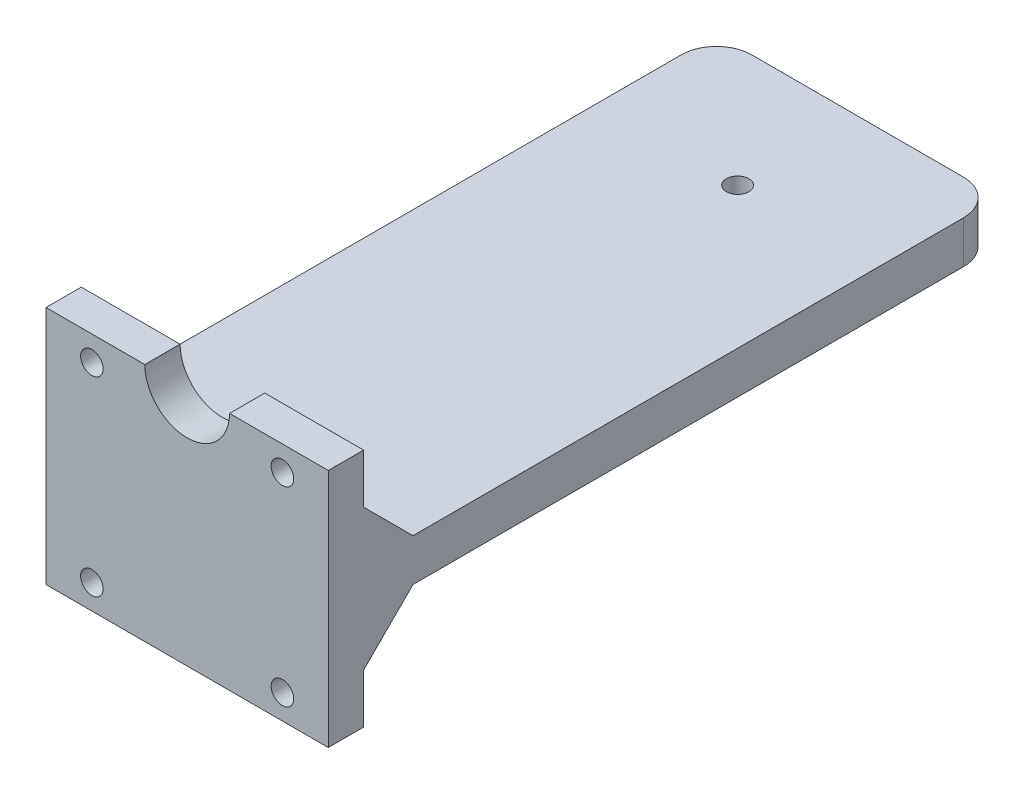
ISO-10303-21;
HEADER;
FILE_DESCRIPTION(('STEP AP214'),'2;1');
FILE_NAME('part.step','',(''),(''),'','','');
FILE_SCHEMA(('AUTOMOTIVE_DESIGN { 1 0 10303 214 1 1 1 1 }'));
ENDSEC;
DATA;
#1=APPLICATION_CONTEXT('core data for automotive mechanical design processes');
#2=APPLICATION_PROTOCOL_DEFINITION('international standard','automotive_design',2000,#1);
#3=PRODUCT_CONTEXT('',#1,'mechanical');
#4=PRODUCT('Part','Part','',(#3));
#5=PRODUCT_RELATED_PRODUCT_CATEGORY('part','',(#4));
#6=PRODUCT_DEFINITION_FORMATION('','',#4);
#7=PRODUCT_DEFINITION_CONTEXT('part definition',#1,'design');
#8=PRODUCT_DEFINITION('design','',#6,#7);
#9=PRODUCT_DEFINITION_SHAPE('','',#8);
#10=(LENGTH_UNIT() NAMED_UNIT(*) SI_UNIT(.MILLI.,.METRE.));
#11=(NAMED_UNIT(*) PLANE_ANGLE_UNIT() SI_UNIT($,.RADIAN.));
#12=(NAMED_UNIT(*) SI_UNIT($,.STERADIAN.) SOLID_ANGLE_UNIT());
#13=UNCERTAINTY_MEASURE_WITH_UNIT(LENGTH_MEASURE(1.E-05),#10,'distance_accuracy_value','');
#14=(GEOMETRIC_REPRESENTATION_CONTEXT(3) GLOBAL_UNCERTAINTY_ASSIGNED_CONTEXT((#13)) GLOBAL_UNIT_ASSIGNED_CONTEXT((#10,
#11,#12)) REPRESENTATION_CONTEXT('',''));
#15=CARTESIAN_POINT('',(0.,0.,0.));
#16=DIRECTION('',(0.,0.,1.));
#17=DIRECTION('',(1.,0.,0.));
#18=AXIS2_PLACEMENT_3D('',#15,#16,#17);
#19=CARTESIAN_POINT('',(0.,0.,0.));
#20=DIRECTION('',(0.,-1.,0.));
#21=DIRECTION('',(0.,0.,-1.));
#22=AXIS2_PLACEMENT_3D('',#19,#20,#21);
#23=PLANE('',#22);
#24=CARTESIAN_POINT('',(0.,0.,-78.));
#25=DIRECTION('',(0.,-1.,0.));
#26=DIRECTION('',(0.,0.,-1.));
#27=AXIS2_PLACEMENT_3D('',#24,#25,#26);
#28=CIRCLE('',#27,7.);
#29=CARTESIAN_POINT('',(0.,0.,-85.));
#30=VERTEX_POINT('',#29);
#31=EDGE_CURVE('E266',#30,#30,#28,.T.);
#32=ORIENTED_EDGE('',*,*,#31,.F.);
#33=EDGE_LOOP('',(#32));
#34=FACE_BOUND('',#33,.T.);
#35=DIRECTION('',(0.,0.,-1.));
#36=VECTOR('',#35,1.);
#37=CARTESIAN_POINT('',(20.,0.,-95.));
#38=LINE('',#37,#36);
#39=CARTESIAN_POINT('',(20.,0.,-12.));
#40=VERTEX_POINT('',#39);
#41=CARTESIAN_POINT('',(20.,0.,-90.));
#42=VERTEX_POINT('',#41);
#43=EDGE_CURVE('E155',#40,#42,#38,.T.);
#44=ORIENTED_EDGE('',*,*,#43,.F.);
#45=DIRECTION('',(-1.,0.,0.));
#46=VECTOR('',#45,1.);
#47=CARTESIAN_POINT('',(20.,0.,-12.));
#48=LINE('',#47,#46);
#49=CARTESIAN_POINT('',(-20.,0.,-12.));
#50=VERTEX_POINT('',#49);
#51=EDGE_CURVE('E141',#40,#50,#48,.T.);
#52=ORIENTED_EDGE('',*,*,#51,.T.);
#53=DIRECTION('',(0.,0.,1.));
#54=VECTOR('',#53,1.);
#55=CARTESIAN_POINT('',(-20.,0.,-95.));
#56=LINE('',#55,#54);
#57=CARTESIAN_POINT('',(-20.,0.,-90.));
#58=VERTEX_POINT('',#57);
#59=EDGE_CURVE('E167',#58,#50,#56,.T.);
#60=ORIENTED_EDGE('',*,*,#59,.F.);
#61=CARTESIAN_POINT('',(-15.,0.,-90.));
#62=DIRECTION('',(0.,-1.,0.));
#63=DIRECTION('',(0.,0.,-1.));
#64=AXIS2_PLACEMENT_3D('',#61,#62,#63);
#65=CIRCLE('',#64,5.);
#66=CARTESIAN_POINT('',(-15.,0.,-95.));
#67=VERTEX_POINT('',#66);
#68=EDGE_CURVE('E217',#58,#67,#65,.T.);
#69=ORIENTED_EDGE('',*,*,#68,.T.);
#70=DIRECTION('',(-1.,0.,0.));
#71=VECTOR('',#70,1.);
#72=CARTESIAN_POINT('',(20.,0.,-95.));
#73=LINE('',#72,#71);
#74=CARTESIAN_POINT('',(15.,0.,-95.));
#75=VERTEX_POINT('',#74);
#76=EDGE_CURVE('E166',#75,#67,#73,.T.);
#77=ORIENTED_EDGE('',*,*,#76,.F.);
#78=CARTESIAN_POINT('',(15.,0.,-90.));
#79=DIRECTION('',(0.,-1.,0.));
#80=DIRECTION('',(0.,0.,-1.));
#81=AXIS2_PLACEMENT_3D('',#78,#79,#80);
#82=CIRCLE('',#81,5.);
#83=EDGE_CURVE('E164',#75,#42,#82,.T.);
#84=ORIENTED_EDGE('',*,*,#83,.T.);
#85=EDGE_LOOP('',(#44,#52,#60,#69,#77,#84));
#86=FACE_BOUND('',#85,.T.);
#87=ADVANCED_FACE('F40',(#34,#86),#23,.T.);
#88=CARTESIAN_POINT('',(0.,20.,0.));
#89=DIRECTION('',(0.,-1.,0.));
#90=DIRECTION('',(0.,0.,-1.));
#91=AXIS2_PLACEMENT_3D('',#88,#89,#90);
#92=PLANE('',#91);
#93=DIRECTION('',(1.,0.,0.));
#94=VECTOR('',#93,1.);
#95=CARTESIAN_POINT('',(-20.,20.,0.));
#96=LINE('',#95,#94);
#97=CARTESIAN_POINT('',(-20.,20.,0.));
#98=VERTEX_POINT('',#97);
#99=CARTESIAN_POINT('',(-6.,20.,0.));
#100=VERTEX_POINT('',#99);
#101=EDGE_CURVE('E324',#98,#100,#96,.T.);
#102=ORIENTED_EDGE('',*,*,#101,.T.);
#103=DIRECTION('',(0.,0.,-1.));
#104=VECTOR('',#103,1.);
#105=CARTESIAN_POINT('',(-6.,20.,9.));
#106=LINE('',#105,#104);
#107=CARTESIAN_POINT('',(-6.,20.,-5.));
#108=VERTEX_POINT('',#107);
#109=EDGE_CURVE('E193',#100,#108,#106,.T.);
#110=ORIENTED_EDGE('',*,*,#109,.T.);
#111=DIRECTION('',(-1.,0.,0.));
#112=VECTOR('',#111,1.);
#113=CARTESIAN_POINT('',(-20.,20.,-5.));
#114=LINE('',#113,#112);
#115=CARTESIAN_POINT('',(-20.,20.,-5.));
#116=VERTEX_POINT('',#115);
#117=EDGE_CURVE('E331',#108,#116,#114,.T.);
#118=ORIENTED_EDGE('',*,*,#117,.T.);
#119=DIRECTION('',(0.,0.,1.));
#120=VECTOR('',#119,1.);
#121=CARTESIAN_POINT('',(-20.,20.,0.));
#122=LINE('',#121,#120);
#123=EDGE_CURVE('E319',#116,#98,#122,.T.);
#124=ORIENTED_EDGE('',*,*,#123,.T.);
#125=EDGE_LOOP('',(#102,#110,#118,#124));
#126=FACE_BOUND('',#125,.T.);
#127=ADVANCED_FACE('F379',(#126),#92,.F.);
#128=CARTESIAN_POINT('',(0.,6.,0.));
#129=DIRECTION('',(0.,-1.,0.));
#130=DIRECTION('',(0.,0.,-1.));
#131=AXIS2_PLACEMENT_3D('',#128,#129,#130);
#132=PLANE('',#131);
#133=CARTESIAN_POINT('',(0.,6.,-78.));
#134=DIRECTION('',(0.,-1.,0.));
#135=DIRECTION('',(0.,0.,-1.));
#136=AXIS2_PLACEMENT_3D('',#133,#134,#135);
#137=CIRCLE('',#136,1.6);
#138=CARTESIAN_POINT('',(0.,6.,-79.6));
#139=VERTEX_POINT('',#138);
#140=EDGE_CURVE('E259',#139,#139,#137,.T.);
#141=ORIENTED_EDGE('',*,*,#140,.T.);
#142=EDGE_LOOP('',(#141));
#143=FACE_BOUND('',#142,.T.);
#144=DIRECTION('',(-1.,0.,0.));
#145=VECTOR('',#144,1.);
#146=CARTESIAN_POINT('',(20.,6.,-95.));
#147=LINE('',#146,#145);
#148=CARTESIAN_POINT('',(15.,6.,-95.));
#149=VERTEX_POINT('',#148);
#150=CARTESIAN_POINT('',(-15.,6.,-95.));
#151=VERTEX_POINT('',#150);
#152=EDGE_CURVE('E186',#149,#151,#147,.T.);
#153=ORIENTED_EDGE('',*,*,#152,.T.);
#154=CARTESIAN_POINT('',(-15.,6.,-90.));
#155=DIRECTION('',(0.,-1.,0.));
#156=DIRECTION('',(0.,0.,-1.));
#157=AXIS2_PLACEMENT_3D('',#154,#155,#156);
#158=CIRCLE('',#157,5.);
#159=CARTESIAN_POINT('',(-20.,6.,-90.));
#160=VERTEX_POINT('',#159);
#161=EDGE_CURVE('E230',#151,#160,#158,.F.);
#162=ORIENTED_EDGE('',*,*,#161,.T.);
#163=DIRECTION('',(0.,0.,1.));
#164=VECTOR('',#163,1.);
#165=CARTESIAN_POINT('',(-20.,6.,-95.));
#166=LINE('',#165,#164);
#167=CARTESIAN_POINT('',(-20.,6.,-12.));
#168=VERTEX_POINT('',#167);
#169=EDGE_CURVE('E175',#160,#168,#166,.T.);
#170=ORIENTED_EDGE('',*,*,#169,.T.);
#171=DIRECTION('',(1.,0.,0.));
#172=VECTOR('',#171,1.);
#173=CARTESIAN_POINT('',(20.,6.,-12.));
#174=LINE('',#173,#172);
#175=CARTESIAN_POINT('',(20.,6.,-12.));
#176=VERTEX_POINT('',#175);
#177=EDGE_CURVE('E201',#168,#176,#174,.T.);
#178=ORIENTED_EDGE('',*,*,#177,.T.);
#179=DIRECTION('',(0.,0.,-1.));
#180=VECTOR('',#179,1.);
#181=CARTESIAN_POINT('',(20.,6.,-95.));
#182=LINE('',#181,#180);
#183=CARTESIAN_POINT('',(20.,6.,-90.));
#184=VERTEX_POINT('',#183);
#185=EDGE_CURVE('E345',#176,#184,#182,.T.);
#186=ORIENTED_EDGE('',*,*,#185,.T.);
#187=CARTESIAN_POINT('',(15.,6.,-90.));
#188=DIRECTION('',(0.,-1.,0.));
#189=DIRECTION('',(0.,0.,-1.));
#190=AXIS2_PLACEMENT_3D('',#187,#188,#189);
#191=CIRCLE('',#190,5.);
#192=EDGE_CURVE('E227',#184,#149,#191,.F.);
#193=ORIENTED_EDGE('',*,*,#192,.T.);
#194=EDGE_LOOP('',(#153,#162,#170,#178,#186,#193));
#195=FACE_BOUND('',#194,.T.);
#196=ADVANCED_FACE('F353',(#143,#195),#132,.F.);
#197=CARTESIAN_POINT('',(-20.,6.,-95.));
#198=DIRECTION('',(1.,0.,0.));
#199=DIRECTION('',(0.,0.,-1.));
#200=AXIS2_PLACEMENT_3D('',#197,#198,#199);
#201=PLANE('',#200);
#202=ORIENTED_EDGE('',*,*,#169,.F.);
#203=DIRECTION('',(0.,-1.,0.));
#204=VECTOR('',#203,1.);
#205=CARTESIAN_POINT('',(-20.,6.,-90.));
#206=LINE('',#205,#204);
#207=EDGE_CURVE('E211',#160,#58,#206,.T.);
#208=ORIENTED_EDGE('',*,*,#207,.T.);
#209=ORIENTED_EDGE('',*,*,#59,.T.);
#210=DIRECTION('',(0.,-0.70710678118655,0.707106781186545));
#211=VECTOR('',#210,1.);
#212=CARTESIAN_POINT('',(-20.,-7.00000000000002,-5.));
#213=LINE('',#212,#211);
#214=CARTESIAN_POINT('',(-20.,-7.00000000000002,-5.));
#215=VERTEX_POINT('',#214);
#216=EDGE_CURVE('E56',#50,#215,#213,.T.);
#217=ORIENTED_EDGE('',*,*,#216,.T.);
#218=DIRECTION('',(0.,-1.,0.));
#219=VECTOR('',#218,1.);
#220=CARTESIAN_POINT('',(-20.,-14.,-5.));
#221=LINE('',#220,#219);
#222=CARTESIAN_POINT('',(-20.,-14.,-5.));
#223=VERTEX_POINT('',#222);
#224=EDGE_CURVE('E282',#215,#223,#221,.T.);
#225=ORIENTED_EDGE('',*,*,#224,.T.);
#226=DIRECTION('',(0.,0.,1.));
#227=VECTOR('',#226,1.);
#228=CARTESIAN_POINT('',(-20.,-14.,0.));
#229=LINE('',#228,#227);
#230=CARTESIAN_POINT('',(-20.,-14.,0.));
#231=VERTEX_POINT('',#230);
#232=EDGE_CURVE('E161',#223,#231,#229,.T.);
#233=ORIENTED_EDGE('',*,*,#232,.T.);
#234=DIRECTION('',(0.,-1.,0.));
#235=VECTOR('',#234,1.);
#236=CARTESIAN_POINT('',(-20.,6.,0.));
#237=LINE('',#236,#235);
#238=EDGE_CURVE('E185',#98,#231,#237,.T.);
#239=ORIENTED_EDGE('',*,*,#238,.F.);
#240=ORIENTED_EDGE('',*,*,#123,.F.);
#241=DIRECTION('',(0.,-1.,0.));
#242=VECTOR('',#241,1.);
#243=CARTESIAN_POINT('',(-20.,20.,-5.));
#244=LINE('',#243,#242);
#245=CARTESIAN_POINT('',(-20.,13.,-5.));
#246=VERTEX_POINT('',#245);
#247=EDGE_CURVE('E336',#116,#246,#244,.T.);
#248=ORIENTED_EDGE('',*,*,#247,.T.);
#249=DIRECTION('',(0.,0.70710678118655,0.707106781186545));
#250=VECTOR('',#249,1.);
#251=CARTESIAN_POINT('',(-20.,-35.5,-53.4999999999997));
#252=LINE('',#251,#250);
#253=EDGE_CURVE('E204',#246,#168,#252,.F.);
#254=ORIENTED_EDGE('',*,*,#253,.T.);
#255=EDGE_LOOP('',(#202,#208,#209,#217,#225,#233,#239,#240,#248,#254));
#256=FACE_BOUND('',#255,.T.);
#257=ADVANCED_FACE('F363',(#256),#201,.F.);
#258=CARTESIAN_POINT('',(20.,6.,0.));
#259=DIRECTION('',(0.,0.,-1.));
#260=DIRECTION('',(-1.,0.,0.));
#261=AXIS2_PLACEMENT_3D('',#258,#259,#260);
#262=PLANE('',#261);
#263=CARTESIAN_POINT('',(13.5,-10.5,0.));
#264=DIRECTION('',(0.,0.,1.));
#265=DIRECTION('',(-1.,0.,0.));
#266=AXIS2_PLACEMENT_3D('',#263,#264,#265);
#267=CIRCLE('',#266,1.6);
#268=CARTESIAN_POINT('',(11.9,-10.5,0.));
#269=VERTEX_POINT('',#268);
#270=EDGE_CURVE('E241',#269,#269,#267,.T.);
#271=ORIENTED_EDGE('',*,*,#270,.F.);
#272=EDGE_LOOP('',(#271));
#273=FACE_BOUND('',#272,.T.);
#274=CARTESIAN_POINT('',(-13.5,-10.5,0.));
#275=DIRECTION('',(0.,0.,1.));
#276=DIRECTION('',(-1.,0.,0.));
#277=AXIS2_PLACEMENT_3D('',#274,#275,#276);
#278=CIRCLE('',#277,1.6);
#279=CARTESIAN_POINT('',(-15.1,-10.5,0.));
#280=VERTEX_POINT('',#279);
#281=EDGE_CURVE('E265',#280,#280,#278,.T.);
#282=ORIENTED_EDGE('',*,*,#281,.F.);
#283=EDGE_LOOP('',(#282));
#284=FACE_BOUND('',#283,.T.);
#285=CARTESIAN_POINT('',(13.5,16.5,0.));
#286=DIRECTION('',(0.,0.,-1.));
#287=DIRECTION('',(-1.,0.,0.));
#288=AXIS2_PLACEMENT_3D('',#285,#286,#287);
#289=CIRCLE('',#288,1.6);
#290=CARTESIAN_POINT('',(11.9,16.5,0.));
#291=VERTEX_POINT('',#290);
#292=EDGE_CURVE('E309',#291,#291,#289,.T.);
#293=ORIENTED_EDGE('',*,*,#292,.T.);
#294=EDGE_LOOP('',(#293));
#295=FACE_BOUND('',#294,.T.);
#296=CARTESIAN_POINT('',(-13.5,16.5,0.));
#297=DIRECTION('',(0.,0.,-1.));
#298=DIRECTION('',(-1.,0.,0.));
#299=AXIS2_PLACEMENT_3D('',#296,#297,#298);
#300=CIRCLE('',#299,1.6);
#301=CARTESIAN_POINT('',(-15.1,16.5,0.));
#302=VERTEX_POINT('',#301);
#303=EDGE_CURVE('E303',#302,#302,#300,.T.);
#304=ORIENTED_EDGE('',*,*,#303,.T.);
#305=EDGE_LOOP('',(#304));
#306=FACE_BOUND('',#305,.T.);
#307=CARTESIAN_POINT('',(6.,20.,0.));
#308=VERTEX_POINT('',#307);
#309=CARTESIAN_POINT('',(20.,20.,0.));
#310=VERTEX_POINT('',#309);
#311=EDGE_CURVE('E323',#308,#310,#96,.T.);
#312=ORIENTED_EDGE('',*,*,#311,.F.);
#313=CARTESIAN_POINT('',(0.,20.,0.));
#314=DIRECTION('',(0.,0.,-1.));
#315=DIRECTION('',(-1.,0.,0.));
#316=AXIS2_PLACEMENT_3D('',#313,#314,#315);
#317=CIRCLE('',#316,6.);
#318=EDGE_CURVE('E315',#308,#100,#317,.T.);
#319=ORIENTED_EDGE('',*,*,#318,.T.);
#320=ORIENTED_EDGE('',*,*,#101,.F.);
#321=ORIENTED_EDGE('',*,*,#238,.T.);
#322=DIRECTION('',(-1.,0.,0.));
#323=VECTOR('',#322,1.);
#324=CARTESIAN_POINT('',(20.,-14.,0.));
#325=LINE('',#324,#323);
#326=CARTESIAN_POINT('',(20.,-14.,0.));
#327=VERTEX_POINT('',#326);
#328=EDGE_CURVE('E289',#327,#231,#325,.T.);
#329=ORIENTED_EDGE('',*,*,#328,.F.);
#330=DIRECTION('',(0.,-1.,0.));
#331=VECTOR('',#330,1.);
#332=CARTESIAN_POINT('',(20.,6.,0.));
#333=LINE('',#332,#331);
#334=EDGE_CURVE('E182',#310,#327,#333,.T.);
#335=ORIENTED_EDGE('',*,*,#334,.F.);
#336=EDGE_LOOP('',(#312,#319,#320,#321,#329,#335));
#337=FACE_BOUND('',#336,.T.);
#338=ADVANCED_FACE('F397',(#273,#284,#295,#306,#337),#262,.F.);
#339=CARTESIAN_POINT('',(20.,6.,-95.));
#340=DIRECTION('',(-1.,0.,0.));
#341=DIRECTION('',(0.,0.,1.));
#342=AXIS2_PLACEMENT_3D('',#339,#340,#341);
#343=PLANE('',#342);
#344=ORIENTED_EDGE('',*,*,#334,.T.);
#345=DIRECTION('',(0.,0.,1.));
#346=VECTOR('',#345,1.);
#347=CARTESIAN_POINT('',(20.,-14.,0.));
#348=LINE('',#347,#346);
#349=CARTESIAN_POINT('',(20.,-14.,-5.00000000000001));
#350=VERTEX_POINT('',#349);
#351=EDGE_CURVE('E151',#350,#327,#348,.T.);
#352=ORIENTED_EDGE('',*,*,#351,.F.);
#353=DIRECTION('',(0.,-1.,0.));
#354=VECTOR('',#353,1.);
#355=CARTESIAN_POINT('',(20.,-14.,-5.00000000000001));
#356=LINE('',#355,#354);
#357=CARTESIAN_POINT('',(20.,-7.00000000000002,-5.00000000000001));
#358=VERTEX_POINT('',#357);
#359=EDGE_CURVE('E159',#358,#350,#356,.T.);
#360=ORIENTED_EDGE('',*,*,#359,.F.);
#361=DIRECTION('',(0.,-0.70710678118655,0.707106781186545));
#362=VECTOR('',#361,1.);
#363=CARTESIAN_POINT('',(20.,-7.00000000000002,-5.00000000000001));
#364=LINE('',#363,#362);
#365=EDGE_CURVE('E144',#40,#358,#364,.T.);
#366=ORIENTED_EDGE('',*,*,#365,.F.);
#367=ORIENTED_EDGE('',*,*,#43,.T.);
#368=DIRECTION('',(0.,-1.,0.));
#369=VECTOR('',#368,1.);
#370=CARTESIAN_POINT('',(20.,6.,-90.));
#371=LINE('',#370,#369);
#372=EDGE_CURVE('E64',#42,#184,#371,.F.);
#373=ORIENTED_EDGE('',*,*,#372,.T.);
#374=ORIENTED_EDGE('',*,*,#185,.F.);
#375=DIRECTION('',(0.,-0.70710678118655,-0.707106781186545));
#376=VECTOR('',#375,1.);
#377=CARTESIAN_POINT('',(20.,-35.5,-53.4999999999997));
#378=LINE('',#377,#376);
#379=CARTESIAN_POINT('',(20.,13.,-5.));
#380=VERTEX_POINT('',#379);
#381=EDGE_CURVE('E208',#176,#380,#378,.F.);
#382=ORIENTED_EDGE('',*,*,#381,.T.);
#383=DIRECTION('',(0.,-1.,0.));
#384=VECTOR('',#383,1.);
#385=CARTESIAN_POINT('',(20.,20.,-5.));
#386=LINE('',#385,#384);
#387=CARTESIAN_POINT('',(20.,20.,-5.));
#388=VERTEX_POINT('',#387);
#389=EDGE_CURVE('E178',#388,#380,#386,.T.);
#390=ORIENTED_EDGE('',*,*,#389,.F.);
#391=DIRECTION('',(0.,0.,-1.));
#392=VECTOR('',#391,1.);
#393=CARTESIAN_POINT('',(20.,20.,0.));
#394=LINE('',#393,#392);
#395=EDGE_CURVE('E328',#310,#388,#394,.T.);
#396=ORIENTED_EDGE('',*,*,#395,.F.);
#397=EDGE_LOOP('',(#344,#352,#360,#366,#367,#373,#374,#382,#390,#396));
#398=FACE_BOUND('',#397,.T.);
#399=ADVANCED_FACE('F154',(#398),#343,.F.);
#400=CARTESIAN_POINT('',(20.,6.,-95.));
#401=DIRECTION('',(0.,0.,1.));
#402=DIRECTION('',(1.,0.,0.));
#403=AXIS2_PLACEMENT_3D('',#400,#401,#402);
#404=PLANE('',#403);
#405=ORIENTED_EDGE('',*,*,#76,.T.);
#406=DIRECTION('',(0.,-1.,0.));
#407=VECTOR('',#406,1.);
#408=CARTESIAN_POINT('',(-15.,6.,-95.));
#409=LINE('',#408,#407);
#410=EDGE_CURVE('E224',#67,#151,#409,.F.);
#411=ORIENTED_EDGE('',*,*,#410,.T.);
#412=ORIENTED_EDGE('',*,*,#152,.F.);
#413=DIRECTION('',(0.,-1.,0.));
#414=VECTOR('',#413,1.);
#415=CARTESIAN_POINT('',(15.,6.,-95.));
#416=LINE('',#415,#414);
#417=EDGE_CURVE('E220',#149,#75,#416,.T.);
#418=ORIENTED_EDGE('',*,*,#417,.T.);
#419=EDGE_LOOP('',(#405,#411,#412,#418));
#420=FACE_BOUND('',#419,.T.);
#421=ADVANCED_FACE('F364',(#420),#404,.F.);
#422=CARTESIAN_POINT('',(-20.,20.,-5.));
#423=DIRECTION('',(0.,0.,1.));
#424=DIRECTION('',(1.,0.,0.));
#425=AXIS2_PLACEMENT_3D('',#422,#423,#424);
#426=PLANE('',#425);
#427=CARTESIAN_POINT('',(13.5,16.5,-5.));
#428=DIRECTION('',(0.,0.,-1.));
#429=DIRECTION('',(-1.,0.,0.));
#430=AXIS2_PLACEMENT_3D('',#427,#428,#429);
#431=CIRCLE('',#430,1.6);
#432=CARTESIAN_POINT('',(11.9,16.5,-5.));
#433=VERTEX_POINT('',#432);
#434=EDGE_CURVE('E299',#433,#433,#431,.T.);
#435=ORIENTED_EDGE('',*,*,#434,.F.);
#436=EDGE_LOOP('',(#435));
#437=FACE_BOUND('',#436,.T.);
#438=CARTESIAN_POINT('',(-13.5,16.5,-5.));
#439=DIRECTION('',(0.,0.,-1.));
#440=DIRECTION('',(-1.,0.,0.));
#441=AXIS2_PLACEMENT_3D('',#438,#439,#440);
#442=CIRCLE('',#441,1.6);
#443=CARTESIAN_POINT('',(-15.1,16.5,-5.));
#444=VERTEX_POINT('',#443);
#445=EDGE_CURVE('E293',#444,#444,#442,.T.);
#446=ORIENTED_EDGE('',*,*,#445,.F.);
#447=EDGE_LOOP('',(#446));
#448=FACE_BOUND('',#447,.T.);
#449=ORIENTED_EDGE('',*,*,#389,.T.);
#450=DIRECTION('',(-1.,0.,0.));
#451=VECTOR('',#450,1.);
#452=CARTESIAN_POINT('',(-20.,13.,-5.));
#453=LINE('',#452,#451);
#454=EDGE_CURVE('E197',#380,#246,#453,.T.);
#455=ORIENTED_EDGE('',*,*,#454,.T.);
#456=ORIENTED_EDGE('',*,*,#247,.F.);
#457=ORIENTED_EDGE('',*,*,#117,.F.);
#458=CARTESIAN_POINT('',(0.,20.,-5.));
#459=DIRECTION('',(0.,0.,-1.));
#460=DIRECTION('',(-1.,0.,0.));
#461=AXIS2_PLACEMENT_3D('',#458,#459,#460);
#462=CIRCLE('',#461,6.);
#463=CARTESIAN_POINT('',(6.,20.,-5.));
#464=VERTEX_POINT('',#463);
#465=EDGE_CURVE('E313',#464,#108,#462,.T.);
#466=ORIENTED_EDGE('',*,*,#465,.F.);
#467=EDGE_CURVE('E332',#388,#464,#114,.T.);
#468=ORIENTED_EDGE('',*,*,#467,.F.);
#469=EDGE_LOOP('',(#449,#455,#456,#457,#466,#468));
#470=FACE_BOUND('',#469,.T.);
#471=ADVANCED_FACE('F394',(#437,#448,#470),#426,.F.);
#472=ORIENTED_EDGE('',*,*,#467,.T.);
#473=DIRECTION('',(0.,0.,-1.));
#474=VECTOR('',#473,1.);
#475=CARTESIAN_POINT('',(6.,20.,9.));
#476=LINE('',#475,#474);
#477=EDGE_CURVE('E189',#464,#308,#476,.F.);
#478=ORIENTED_EDGE('',*,*,#477,.T.);
#479=ORIENTED_EDGE('',*,*,#311,.T.);
#480=ORIENTED_EDGE('',*,*,#395,.T.);
#481=EDGE_LOOP('',(#472,#478,#479,#480));
#482=FACE_BOUND('',#481,.T.);
#483=ADVANCED_FACE('F387',(#482),#92,.F.);
#484=CARTESIAN_POINT('',(0.,20.,9.));
#485=DIRECTION('',(0.,0.,-1.));
#486=DIRECTION('',(-1.,0.,0.));
#487=AXIS2_PLACEMENT_3D('',#484,#485,#486);
#488=CYLINDRICAL_SURFACE('',#487,6.);
#489=ORIENTED_EDGE('',*,*,#318,.F.);
#490=ORIENTED_EDGE('',*,*,#477,.F.);
#491=ORIENTED_EDGE('',*,*,#465,.T.);
#492=ORIENTED_EDGE('',*,*,#109,.F.);
#493=EDGE_LOOP('',(#489,#490,#491,#492));
#494=FACE_BOUND('',#493,.T.);
#495=ADVANCED_FACE('F497',(#494),#488,.F.);
#496=CARTESIAN_POINT('',(-13.5,16.5,9.));
#497=DIRECTION('',(0.,0.,-1.));
#498=DIRECTION('',(-1.,0.,0.));
#499=AXIS2_PLACEMENT_3D('',#496,#497,#498);
#500=CYLINDRICAL_SURFACE('',#499,1.6);
#501=ORIENTED_EDGE('',*,*,#445,.T.);
#502=EDGE_LOOP('',(#501));
#503=FACE_BOUND('',#502,.T.);
#504=ORIENTED_EDGE('',*,*,#303,.F.);
#505=EDGE_LOOP('',(#504));
#506=FACE_BOUND('',#505,.T.);
#507=ADVANCED_FACE('F409',(#503,#506),#500,.F.);
#508=CARTESIAN_POINT('',(13.5,16.5,9.));
#509=DIRECTION('',(0.,0.,-1.));
#510=DIRECTION('',(-1.,0.,0.));
#511=AXIS2_PLACEMENT_3D('',#508,#509,#510);
#512=CYLINDRICAL_SURFACE('',#511,1.6);
#513=ORIENTED_EDGE('',*,*,#434,.T.);
#514=EDGE_LOOP('',(#513));
#515=FACE_BOUND('',#514,.T.);
#516=ORIENTED_EDGE('',*,*,#292,.F.);
#517=EDGE_LOOP('',(#516));
#518=FACE_BOUND('',#517,.T.);
#519=ADVANCED_FACE('F404',(#515,#518),#512,.F.);
#520=CARTESIAN_POINT('',(-20.,13.,-5.));
#521=DIRECTION('',(0.,0.707106781186545,-0.70710678118655));
#522=DIRECTION('',(1.,0.,0.));
#523=AXIS2_PLACEMENT_3D('',#520,#521,#522);
#524=PLANE('',#523);
#525=ORIENTED_EDGE('',*,*,#381,.F.);
#526=ORIENTED_EDGE('',*,*,#177,.F.);
#527=ORIENTED_EDGE('',*,*,#253,.F.);
#528=ORIENTED_EDGE('',*,*,#454,.F.);
#529=EDGE_LOOP('',(#525,#526,#527,#528));
#530=FACE_BOUND('',#529,.T.);
#531=ADVANCED_FACE('F376',(#530),#524,.T.);
#532=CARTESIAN_POINT('',(-15.,6.,-90.));
#533=DIRECTION('',(0.,-1.,0.));
#534=DIRECTION('',(0.,0.,-1.));
#535=AXIS2_PLACEMENT_3D('',#532,#533,#534);
#536=CYLINDRICAL_SURFACE('',#535,5.);
#537=ORIENTED_EDGE('',*,*,#161,.F.);
#538=ORIENTED_EDGE('',*,*,#410,.F.);
#539=ORIENTED_EDGE('',*,*,#68,.F.);
#540=ORIENTED_EDGE('',*,*,#207,.F.);
#541=EDGE_LOOP('',(#537,#538,#539,#540));
#542=FACE_BOUND('',#541,.T.);
#543=ADVANCED_FACE('F361',(#542),#536,.T.);
#544=CARTESIAN_POINT('',(15.,6.,-90.));
#545=DIRECTION('',(0.,-1.,0.));
#546=DIRECTION('',(0.,0.,-1.));
#547=AXIS2_PLACEMENT_3D('',#544,#545,#546);
#548=CYLINDRICAL_SURFACE('',#547,5.);
#549=ORIENTED_EDGE('',*,*,#192,.F.);
#550=ORIENTED_EDGE('',*,*,#372,.F.);
#551=ORIENTED_EDGE('',*,*,#83,.F.);
#552=ORIENTED_EDGE('',*,*,#417,.F.);
#553=EDGE_LOOP('',(#549,#550,#551,#552));
#554=FACE_BOUND('',#553,.T.);
#555=ADVANCED_FACE('F366',(#554),#548,.T.);
#556=CARTESIAN_POINT('',(20.,-14.,0.));
#557=DIRECTION('',(0.,-1.,0.));
#558=DIRECTION('',(0.,0.,-1.));
#559=AXIS2_PLACEMENT_3D('',#556,#557,#558);
#560=PLANE('',#559);
#561=ORIENTED_EDGE('',*,*,#232,.F.);
#562=DIRECTION('',(-1.,0.,0.));
#563=VECTOR('',#562,1.);
#564=CARTESIAN_POINT('',(20.,-14.,-5.00000000000001));
#565=LINE('',#564,#563);
#566=EDGE_CURVE('E294',#350,#223,#565,.T.);
#567=ORIENTED_EDGE('',*,*,#566,.F.);
#568=ORIENTED_EDGE('',*,*,#351,.T.);
#569=ORIENTED_EDGE('',*,*,#328,.T.);
#570=EDGE_LOOP('',(#561,#567,#568,#569));
#571=FACE_BOUND('',#570,.T.);
#572=ADVANCED_FACE('F368',(#571),#560,.T.);
#573=CARTESIAN_POINT('',(20.,-14.,-5.00000000000001));
#574=DIRECTION('',(0.,0.,-1.));
#575=DIRECTION('',(-1.,0.,0.));
#576=AXIS2_PLACEMENT_3D('',#573,#574,#575);
#577=PLANE('',#576);
#578=CARTESIAN_POINT('',(13.5,-10.5,-5.));
#579=DIRECTION('',(0.,0.,-1.));
#580=DIRECTION('',(-1.,0.,0.));
#581=AXIS2_PLACEMENT_3D('',#578,#579,#580);
#582=CIRCLE('',#581,1.6);
#583=CARTESIAN_POINT('',(11.9,-10.5,-5.));
#584=VERTEX_POINT('',#583);
#585=EDGE_CURVE('E240',#584,#584,#582,.T.);
#586=ORIENTED_EDGE('',*,*,#585,.F.);
#587=EDGE_LOOP('',(#586));
#588=FACE_BOUND('',#587,.T.);
#589=CARTESIAN_POINT('',(-13.5,-10.5,-5.));
#590=DIRECTION('',(0.,0.,-1.));
#591=DIRECTION('',(-1.,0.,0.));
#592=AXIS2_PLACEMENT_3D('',#589,#590,#591);
#593=CIRCLE('',#592,1.6);
#594=CARTESIAN_POINT('',(-15.1,-10.5,-5.));
#595=VERTEX_POINT('',#594);
#596=EDGE_CURVE('E236',#595,#595,#593,.T.);
#597=ORIENTED_EDGE('',*,*,#596,.F.);
#598=EDGE_LOOP('',(#597));
#599=FACE_BOUND('',#598,.T.);
#600=ORIENTED_EDGE('',*,*,#224,.F.);
#601=DIRECTION('',(-1.,0.,0.));
#602=VECTOR('',#601,1.);
#603=CARTESIAN_POINT('',(20.,-7.00000000000002,-5.00000000000001));
#604=LINE('',#603,#602);
#605=EDGE_CURVE('E150',#358,#215,#604,.T.);
#606=ORIENTED_EDGE('',*,*,#605,.F.);
#607=ORIENTED_EDGE('',*,*,#359,.T.);
#608=ORIENTED_EDGE('',*,*,#566,.T.);
#609=EDGE_LOOP('',(#600,#606,#607,#608));
#610=FACE_BOUND('',#609,.T.);
#611=ADVANCED_FACE('F373',(#588,#599,#610),#577,.T.);
#612=CARTESIAN_POINT('',(20.,-7.00000000000002,-5.00000000000001));
#613=DIRECTION('',(0.,-0.707106781186545,-0.70710678118655));
#614=DIRECTION('',(0.,0.70710678118655,-0.707106781186545));
#615=AXIS2_PLACEMENT_3D('',#612,#613,#614);
#616=PLANE('',#615);
#617=ORIENTED_EDGE('',*,*,#216,.F.);
#618=ORIENTED_EDGE('',*,*,#51,.F.);
#619=ORIENTED_EDGE('',*,*,#365,.T.);
#620=ORIENTED_EDGE('',*,*,#605,.T.);
#621=EDGE_LOOP('',(#617,#618,#619,#620));
#622=FACE_BOUND('',#621,.T.);
#623=ADVANCED_FACE('F143',(#622),#616,.T.);
#624=CARTESIAN_POINT('',(-13.5,-10.5,-40.));
#625=DIRECTION('',(0.,0.,1.));
#626=DIRECTION('',(1.,0.,0.));
#627=AXIS2_PLACEMENT_3D('',#624,#625,#626);
#628=CYLINDRICAL_SURFACE('',#627,1.6);
#629=ORIENTED_EDGE('',*,*,#596,.T.);
#630=EDGE_LOOP('',(#629));
#631=FACE_BOUND('',#630,.T.);
#632=ORIENTED_EDGE('',*,*,#281,.T.);
#633=EDGE_LOOP('',(#632));
#634=FACE_BOUND('',#633,.T.);
#635=ADVANCED_FACE('F547',(#631,#634),#628,.F.);
#636=CARTESIAN_POINT('',(13.5,-10.5,-40.));
#637=DIRECTION('',(0.,0.,1.));
#638=DIRECTION('',(1.,0.,0.));
#639=AXIS2_PLACEMENT_3D('',#636,#637,#638);
#640=CYLINDRICAL_SURFACE('',#639,1.6);
#641=ORIENTED_EDGE('',*,*,#585,.T.);
#642=EDGE_LOOP('',(#641));
#643=FACE_BOUND('',#642,.T.);
#644=ORIENTED_EDGE('',*,*,#270,.T.);
#645=EDGE_LOOP('',(#644));
#646=FACE_BOUND('',#645,.T.);
#647=ADVANCED_FACE('F554',(#643,#646),#640,.F.);
#648=CARTESIAN_POINT('',(0.,-2.,-78.));
#649=DIRECTION('',(0.,1.,0.));
#650=DIRECTION('',(0.,0.,1.));
#651=AXIS2_PLACEMENT_3D('',#648,#649,#650);
#652=CYLINDRICAL_SURFACE('',#651,7.);
#653=CARTESIAN_POINT('',(0.,-2.,-78.));
#654=DIRECTION('',(0.,-1.,0.));
#655=DIRECTION('',(0.,0.,-1.));
#656=AXIS2_PLACEMENT_3D('',#653,#654,#655);
#657=CIRCLE('',#656,7.);
#658=CARTESIAN_POINT('',(0.,-2.,-85.));
#659=VERTEX_POINT('',#658);
#660=EDGE_CURVE('E261',#659,#659,#657,.T.);
#661=ORIENTED_EDGE('',*,*,#660,.F.);
#662=EDGE_LOOP('',(#661));
#663=FACE_BOUND('',#662,.T.);
#664=ORIENTED_EDGE('',*,*,#31,.T.);
#665=EDGE_LOOP('',(#664));
#666=FACE_BOUND('',#665,.T.);
#667=ADVANCED_FACE('F563',(#663,#666),#652,.T.);
#668=CARTESIAN_POINT('',(0.,-2.,-78.));
#669=DIRECTION('',(0.,-1.,0.));
#670=DIRECTION('',(0.,0.,-1.));
#671=AXIS2_PLACEMENT_3D('',#668,#669,#670);
#672=PLANE('',#671);
#673=CARTESIAN_POINT('',(0.,-2.,-78.));
#674=DIRECTION('',(0.,-1.,0.));
#675=DIRECTION('',(0.,0.,-1.));
#676=AXIS2_PLACEMENT_3D('',#673,#674,#675);
#677=CIRCLE('',#676,6.05);
#678=CARTESIAN_POINT('',(0.,-2.,-84.05));
#679=VERTEX_POINT('',#678);
#680=EDGE_CURVE('E235',#679,#679,#677,.T.);
#681=ORIENTED_EDGE('',*,*,#680,.F.);
#682=EDGE_LOOP('',(#681));
#683=FACE_BOUND('',#682,.T.);
#684=ORIENTED_EDGE('',*,*,#660,.T.);
#685=EDGE_LOOP('',(#684));
#686=FACE_BOUND('',#685,.T.);
#687=ADVANCED_FACE('F573',(#683,#686),#672,.T.);
#688=CARTESIAN_POINT('',(0.,-6.,-78.));
#689=DIRECTION('',(0.,1.,0.));
#690=DIRECTION('',(0.,0.,1.));
#691=AXIS2_PLACEMENT_3D('',#688,#689,#690);
#692=CYLINDRICAL_SURFACE('',#691,6.05);
#693=CARTESIAN_POINT('',(0.,-5.50000000000001,-78.));
#694=DIRECTION('',(0.,-1.,0.));
#695=DIRECTION('',(0.,0.,-1.));
#696=AXIS2_PLACEMENT_3D('',#693,#694,#695);
#697=CIRCLE('',#696,6.05);
#698=CARTESIAN_POINT('',(0.,-5.50000000000001,-84.05));
#699=VERTEX_POINT('',#698);
#700=EDGE_CURVE('E11',#699,#699,#697,.F.);
#701=ORIENTED_EDGE('',*,*,#700,.T.);
#702=EDGE_LOOP('',(#701));
#703=FACE_BOUND('',#702,.T.);
#704=ORIENTED_EDGE('',*,*,#680,.T.);
#705=EDGE_LOOP('',(#704));
#706=FACE_BOUND('',#705,.T.);
#707=ADVANCED_FACE('F583',(#703,#706),#692,.T.);
#708=CARTESIAN_POINT('',(0.,-6.,-78.));
#709=DIRECTION('',(0.,-1.,0.));
#710=DIRECTION('',(0.,0.,-1.));
#711=AXIS2_PLACEMENT_3D('',#708,#709,#710);
#712=PLANE('',#711);
#713=CARTESIAN_POINT('',(0.,-6.,-78.));
#714=DIRECTION('',(0.,-1.,0.));
#715=DIRECTION('',(0.,0.,-1.));
#716=AXIS2_PLACEMENT_3D('',#713,#714,#715);
#717=CIRCLE('',#716,1.6);
#718=CARTESIAN_POINT('',(0.,-6.,-79.6));
#719=VERTEX_POINT('',#718);
#720=EDGE_CURVE('E451',#719,#719,#717,.T.);
#721=ORIENTED_EDGE('',*,*,#720,.F.);
#722=EDGE_LOOP('',(#721));
#723=FACE_BOUND('',#722,.T.);
#724=CARTESIAN_POINT('',(0.,-6.,-78.));
#725=DIRECTION('',(0.,-1.,0.));
#726=DIRECTION('',(0.,0.,-1.));
#727=AXIS2_PLACEMENT_3D('',#724,#725,#726);
#728=CIRCLE('',#727,5.55000000000001);
#729=CARTESIAN_POINT('',(0.,-6.,-83.55));
#730=VERTEX_POINT('',#729);
#731=EDGE_CURVE('E49',#730,#730,#728,.T.);
#732=ORIENTED_EDGE('',*,*,#731,.T.);
#733=EDGE_LOOP('',(#732));
#734=FACE_BOUND('',#733,.T.);
#735=ADVANCED_FACE('F592',(#723,#734),#712,.T.);
#736=CARTESIAN_POINT('',(0.,-6.,-78.));
#737=DIRECTION('',(0.,1.,0.));
#738=DIRECTION('',(0.,0.,1.));
#739=AXIS2_PLACEMENT_3D('',#736,#737,#738);
#740=CONICAL_SURFACE('',#739,5.55000000000001,0.785398163397441);
#741=ORIENTED_EDGE('',*,*,#700,.F.);
#742=EDGE_LOOP('',(#741));
#743=FACE_BOUND('',#742,.T.);
#744=ORIENTED_EDGE('',*,*,#731,.F.);
#745=EDGE_LOOP('',(#744));
#746=FACE_BOUND('',#745,.T.);
#747=ADVANCED_FACE('F42',(#743,#746),#740,.T.);
#748=CARTESIAN_POINT('',(0.,20.,-78.));
#749=DIRECTION('',(0.,-1.,0.));
#750=DIRECTION('',(0.,0.,-1.));
#751=AXIS2_PLACEMENT_3D('',#748,#749,#750);
#752=CYLINDRICAL_SURFACE('',#751,1.6);
#753=ORIENTED_EDGE('',*,*,#720,.T.);
#754=EDGE_LOOP('',(#753));
#755=FACE_BOUND('',#754,.T.);
#756=ORIENTED_EDGE('',*,*,#140,.F.);
#757=EDGE_LOOP('',(#756));
#758=FACE_BOUND('',#757,.T.);
#759=ADVANCED_FACE('F609',(#755,#758),#752,.F.);
#760=CLOSED_SHELL('',(#87,#127,#196,#257,#338,#399,#421,#471,#483,#495,#507,#519,#531,#543,#555,
#572,#611,#623,#635,#647,#667,#687,#707,#735,#747,#759));
#761=MANIFOLD_SOLID_BREP('B2',#760);
#762=ADVANCED_BREP_SHAPE_REPRESENTATION('',(#18,#761),#14);
#763=SHAPE_DEFINITION_REPRESENTATION(#9,#762);
ENDSEC;
END-ISO-10303-21;
